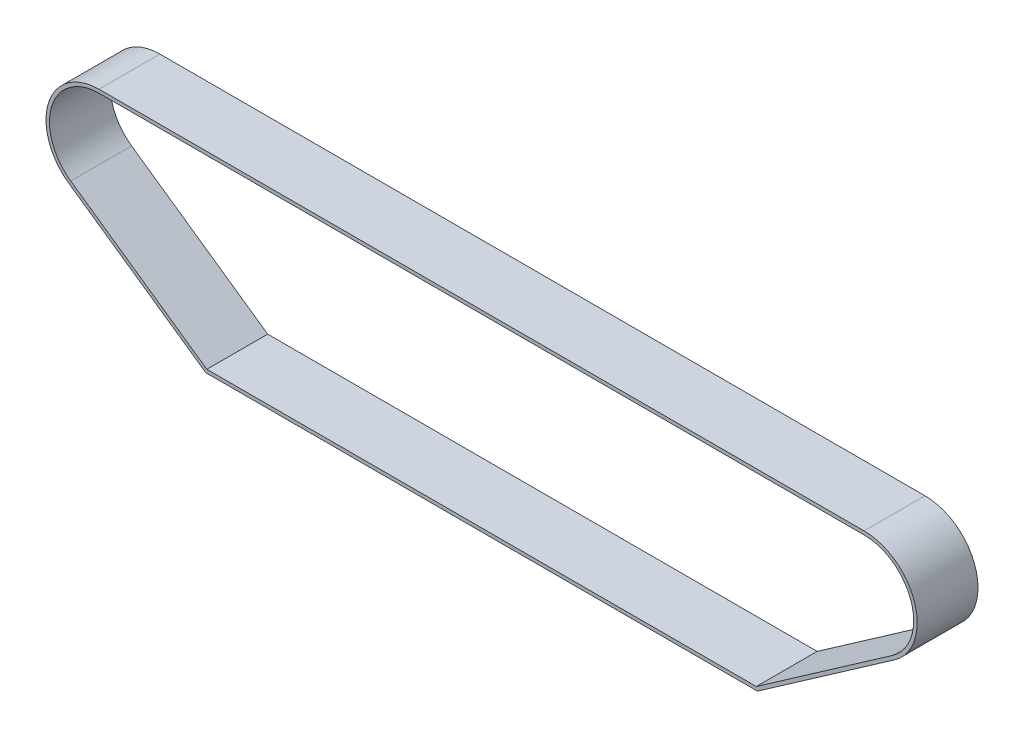
ISO-10303-21;
HEADER;
FILE_DESCRIPTION(('STEP AP214'),'2;1');
FILE_NAME('part.step','',(''),(''),'','','');
FILE_SCHEMA(('AUTOMOTIVE_DESIGN { 1 0 10303 214 1 1 1 1 }'));
ENDSEC;
DATA;
#1=APPLICATION_CONTEXT('core data for automotive mechanical design processes');
#2=APPLICATION_PROTOCOL_DEFINITION('international standard','automotive_design',2000,#1);
#3=PRODUCT_CONTEXT('',#1,'mechanical');
#4=PRODUCT('Part','Part','',(#3));
#5=PRODUCT_RELATED_PRODUCT_CATEGORY('part','',(#4));
#6=PRODUCT_DEFINITION_FORMATION('','',#4);
#7=PRODUCT_DEFINITION_CONTEXT('part definition',#1,'design');
#8=PRODUCT_DEFINITION('design','',#6,#7);
#9=PRODUCT_DEFINITION_SHAPE('','',#8);
#10=(LENGTH_UNIT() NAMED_UNIT(*) SI_UNIT(.MILLI.,.METRE.));
#11=(NAMED_UNIT(*) PLANE_ANGLE_UNIT() SI_UNIT($,.RADIAN.));
#12=(NAMED_UNIT(*) SI_UNIT($,.STERADIAN.) SOLID_ANGLE_UNIT());
#13=UNCERTAINTY_MEASURE_WITH_UNIT(LENGTH_MEASURE(1.E-05),#10,'distance_accuracy_value','');
#14=(GEOMETRIC_REPRESENTATION_CONTEXT(3) GLOBAL_UNCERTAINTY_ASSIGNED_CONTEXT((#13)) GLOBAL_UNIT_ASSIGNED_CONTEXT((#10,
#11,#12)) REPRESENTATION_CONTEXT('',''));
#15=CARTESIAN_POINT('',(0.,0.,0.));
#16=DIRECTION('',(0.,0.,1.));
#17=DIRECTION('',(1.,0.,0.));
#18=AXIS2_PLACEMENT_3D('',#15,#16,#17);
#19=CARTESIAN_POINT('',(-220.,0.,35.));
#20=DIRECTION('',(0.,0.,1.));
#21=DIRECTION('',(1.,0.,0.));
#22=AXIS2_PLACEMENT_3D('',#19,#20,#21);
#23=PLANE('',#22);
#24=CARTESIAN_POINT('',(-220.,0.,35.));
#25=DIRECTION('',(0.,0.,1.));
#26=DIRECTION('',(1.,0.,0.));
#27=AXIS2_PLACEMENT_3D('',#24,#25,#26);
#28=CIRCLE('',#27,30.5);
#29=CARTESIAN_POINT('',(-220.,30.5,35.));
#30=VERTEX_POINT('',#29);
#31=CARTESIAN_POINT('',(-237.450135308847,-25.0148511429297,35.));
#32=VERTEX_POINT('',#31);
#33=EDGE_CURVE('E212',#30,#32,#28,.T.);
#34=ORIENTED_EDGE('',*,*,#33,.T.);
#35=DIRECTION('',(0.820159053866547,-0.572135583896624,0.));
#36=VECTOR('',#35,1.);
#37=CARTESIAN_POINT('',(-159.144271167793,-79.6403181077331,35.));
#38=LINE('',#37,#36);
#39=CARTESIAN_POINT('',(-158.628665481383,-80.,35.));
#40=VERTEX_POINT('',#39);
#41=EDGE_CURVE('E215',#32,#40,#38,.T.);
#42=ORIENTED_EDGE('',*,*,#41,.T.);
#43=DIRECTION('',(1.,0.,0.));
#44=VECTOR('',#43,1.);
#45=CARTESIAN_POINT('',(158.,-80.,35.));
#46=LINE('',#45,#44);
#47=CARTESIAN_POINT('',(158.628665481383,-80.,35.));
#48=VERTEX_POINT('',#47);
#49=EDGE_CURVE('E218',#40,#48,#46,.T.);
#50=ORIENTED_EDGE('',*,*,#49,.T.);
#51=DIRECTION('',(0.820159053866547,0.572135583896624,0.));
#52=VECTOR('',#51,1.);
#53=CARTESIAN_POINT('',(159.144271167793,-79.6403181077331,35.));
#54=LINE('',#53,#52);
#55=CARTESIAN_POINT('',(237.450135308847,-25.0148511429296,35.));
#56=VERTEX_POINT('',#55);
#57=EDGE_CURVE('E220',#48,#56,#54,.T.);
#58=ORIENTED_EDGE('',*,*,#57,.T.);
#59=CARTESIAN_POINT('',(220.,0.,35.));
#60=DIRECTION('',(0.,0.,1.));
#61=DIRECTION('',(1.,0.,0.));
#62=AXIS2_PLACEMENT_3D('',#59,#60,#61);
#63=CIRCLE('',#62,30.5);
#64=CARTESIAN_POINT('',(220.,30.5000000000001,35.));
#65=VERTEX_POINT('',#64);
#66=EDGE_CURVE('E222',#56,#65,#63,.T.);
#67=ORIENTED_EDGE('',*,*,#66,.T.);
#68=DIRECTION('',(-1.,0.,0.));
#69=VECTOR('',#68,1.);
#70=CARTESIAN_POINT('',(-220.,30.5,35.));
#71=LINE('',#70,#69);
#72=EDGE_CURVE('E224',#65,#30,#71,.T.);
#73=ORIENTED_EDGE('',*,*,#72,.T.);
#74=EDGE_LOOP('',(#34,#42,#50,#58,#67,#73));
#75=FACE_BOUND('',#74,.T.);
#76=DIRECTION('',(0.820159053866547,-0.572135583896624,0.));
#77=VECTOR('',#76,1.);
#78=CARTESIAN_POINT('',(-158.,-78.,35.));
#79=LINE('',#78,#77);
#80=CARTESIAN_POINT('',(-236.305864141054,-23.3745330351966,35.));
#81=VERTEX_POINT('',#80);
#82=CARTESIAN_POINT('',(-158.,-78.,35.));
#83=VERTEX_POINT('',#82);
#84=EDGE_CURVE('E169',#81,#83,#79,.T.);
#85=ORIENTED_EDGE('',*,*,#84,.F.);
#86=CARTESIAN_POINT('',(-220.,0.,35.));
#87=DIRECTION('',(0.,0.,1.));
#88=DIRECTION('',(1.,0.,0.));
#89=AXIS2_PLACEMENT_3D('',#86,#87,#88);
#90=CIRCLE('',#89,28.5);
#91=CARTESIAN_POINT('',(-220.,28.5,35.));
#92=VERTEX_POINT('',#91);
#93=EDGE_CURVE('E161',#92,#81,#90,.T.);
#94=ORIENTED_EDGE('',*,*,#93,.F.);
#95=DIRECTION('',(-1.,0.,0.));
#96=VECTOR('',#95,1.);
#97=CARTESIAN_POINT('',(-220.,28.5,35.));
#98=LINE('',#97,#96);
#99=CARTESIAN_POINT('',(220.,28.5000000000001,35.));
#100=VERTEX_POINT('',#99);
#101=EDGE_CURVE('E190',#100,#92,#98,.T.);
#102=ORIENTED_EDGE('',*,*,#101,.F.);
#103=CARTESIAN_POINT('',(220.,0.,35.));
#104=DIRECTION('',(0.,0.,1.));
#105=DIRECTION('',(1.,0.,0.));
#106=AXIS2_PLACEMENT_3D('',#103,#104,#105);
#107=CIRCLE('',#106,28.5);
#108=CARTESIAN_POINT('',(236.305864141054,-23.3745330351965,35.));
#109=VERTEX_POINT('',#108);
#110=EDGE_CURVE('E188',#109,#100,#107,.T.);
#111=ORIENTED_EDGE('',*,*,#110,.F.);
#112=DIRECTION('',(0.820159053866547,0.572135583896624,0.));
#113=VECTOR('',#112,1.);
#114=CARTESIAN_POINT('',(158.,-78.,35.));
#115=LINE('',#114,#113);
#116=CARTESIAN_POINT('',(158.,-78.,35.));
#117=VERTEX_POINT('',#116);
#118=EDGE_CURVE('E184',#117,#109,#115,.T.);
#119=ORIENTED_EDGE('',*,*,#118,.F.);
#120=DIRECTION('',(1.,0.,0.));
#121=VECTOR('',#120,1.);
#122=CARTESIAN_POINT('',(158.,-78.,35.));
#123=LINE('',#122,#121);
#124=EDGE_CURVE('E182',#83,#117,#123,.T.);
#125=ORIENTED_EDGE('',*,*,#124,.F.);
#126=EDGE_LOOP('',(#85,#94,#102,#111,#119,#125));
#127=FACE_BOUND('',#126,.T.);
#128=ADVANCED_FACE('F72',(#75,#127),#23,.T.);
#129=CARTESIAN_POINT('',(-220.,0.,0.));
#130=DIRECTION('',(0.,0.,1.));
#131=DIRECTION('',(1.,0.,0.));
#132=AXIS2_PLACEMENT_3D('',#129,#130,#131);
#133=PLANE('',#132);
#134=CARTESIAN_POINT('',(-220.,0.,0.));
#135=DIRECTION('',(0.,0.,1.));
#136=DIRECTION('',(1.,0.,0.));
#137=AXIS2_PLACEMENT_3D('',#134,#135,#136);
#138=CIRCLE('',#137,30.5);
#139=CARTESIAN_POINT('',(-220.,30.5,0.));
#140=VERTEX_POINT('',#139);
#141=CARTESIAN_POINT('',(-237.450135308847,-25.0148511429297,0.));
#142=VERTEX_POINT('',#141);
#143=EDGE_CURVE('E177',#140,#142,#138,.T.);
#144=ORIENTED_EDGE('',*,*,#143,.F.);
#145=DIRECTION('',(-1.,0.,0.));
#146=VECTOR('',#145,1.);
#147=CARTESIAN_POINT('',(-220.,30.5,0.));
#148=LINE('',#147,#146);
#149=CARTESIAN_POINT('',(220.,30.5000000000001,0.));
#150=VERTEX_POINT('',#149);
#151=EDGE_CURVE('E216',#150,#140,#148,.T.);
#152=ORIENTED_EDGE('',*,*,#151,.F.);
#153=CARTESIAN_POINT('',(220.,0.,0.));
#154=DIRECTION('',(0.,0.,1.));
#155=DIRECTION('',(1.,0.,0.));
#156=AXIS2_PLACEMENT_3D('',#153,#154,#155);
#157=CIRCLE('',#156,30.5);
#158=CARTESIAN_POINT('',(237.450135308847,-25.0148511429296,0.));
#159=VERTEX_POINT('',#158);
#160=EDGE_CURVE('E235',#159,#150,#157,.T.);
#161=ORIENTED_EDGE('',*,*,#160,.F.);
#162=DIRECTION('',(0.820159053866547,0.572135583896624,0.));
#163=VECTOR('',#162,1.);
#164=CARTESIAN_POINT('',(159.144271167793,-79.6403181077331,0.));
#165=LINE('',#164,#163);
#166=CARTESIAN_POINT('',(158.628665481383,-80.,0.));
#167=VERTEX_POINT('',#166);
#168=EDGE_CURVE('E233',#167,#159,#165,.T.);
#169=ORIENTED_EDGE('',*,*,#168,.F.);
#170=DIRECTION('',(1.,0.,0.));
#171=VECTOR('',#170,1.);
#172=CARTESIAN_POINT('',(158.,-80.,0.));
#173=LINE('',#172,#171);
#174=CARTESIAN_POINT('',(-158.628665481383,-80.,0.));
#175=VERTEX_POINT('',#174);
#176=EDGE_CURVE('E231',#175,#167,#173,.T.);
#177=ORIENTED_EDGE('',*,*,#176,.F.);
#178=DIRECTION('',(0.820159053866547,-0.572135583896624,0.));
#179=VECTOR('',#178,1.);
#180=CARTESIAN_POINT('',(-159.144271167793,-79.6403181077331,0.));
#181=LINE('',#180,#179);
#182=EDGE_CURVE('E229',#142,#175,#181,.T.);
#183=ORIENTED_EDGE('',*,*,#182,.F.);
#184=EDGE_LOOP('',(#144,#152,#161,#169,#177,#183));
#185=FACE_BOUND('',#184,.T.);
#186=CARTESIAN_POINT('',(-220.,0.,0.));
#187=DIRECTION('',(0.,0.,1.));
#188=DIRECTION('',(1.,0.,0.));
#189=AXIS2_PLACEMENT_3D('',#186,#187,#188);
#190=CIRCLE('',#189,28.5);
#191=CARTESIAN_POINT('',(-220.,28.5,0.));
#192=VERTEX_POINT('',#191);
#193=CARTESIAN_POINT('',(-236.305864141054,-23.3745330351966,0.));
#194=VERTEX_POINT('',#193);
#195=EDGE_CURVE('E95',#192,#194,#190,.T.);
#196=ORIENTED_EDGE('',*,*,#195,.T.);
#197=DIRECTION('',(0.820159053866547,-0.572135583896624,0.));
#198=VECTOR('',#197,1.);
#199=CARTESIAN_POINT('',(-158.,-78.,0.));
#200=LINE('',#199,#198);
#201=CARTESIAN_POINT('',(-158.,-78.,0.));
#202=VERTEX_POINT('',#201);
#203=EDGE_CURVE('E176',#194,#202,#200,.T.);
#204=ORIENTED_EDGE('',*,*,#203,.T.);
#205=DIRECTION('',(1.,0.,0.));
#206=VECTOR('',#205,1.);
#207=CARTESIAN_POINT('',(158.,-78.,0.));
#208=LINE('',#207,#206);
#209=CARTESIAN_POINT('',(158.,-78.,0.));
#210=VERTEX_POINT('',#209);
#211=EDGE_CURVE('E194',#202,#210,#208,.T.);
#212=ORIENTED_EDGE('',*,*,#211,.T.);
#213=DIRECTION('',(0.820159053866547,0.572135583896624,0.));
#214=VECTOR('',#213,1.);
#215=CARTESIAN_POINT('',(158.,-78.,0.));
#216=LINE('',#215,#214);
#217=CARTESIAN_POINT('',(236.305864141054,-23.3745330351965,0.));
#218=VERTEX_POINT('',#217);
#219=EDGE_CURVE('E197',#210,#218,#216,.T.);
#220=ORIENTED_EDGE('',*,*,#219,.T.);
#221=CARTESIAN_POINT('',(220.,0.,0.));
#222=DIRECTION('',(0.,0.,1.));
#223=DIRECTION('',(1.,0.,0.));
#224=AXIS2_PLACEMENT_3D('',#221,#222,#223);
#225=CIRCLE('',#224,28.5);
#226=CARTESIAN_POINT('',(220.,28.5000000000001,0.));
#227=VERTEX_POINT('',#226);
#228=EDGE_CURVE('E200',#218,#227,#225,.T.);
#229=ORIENTED_EDGE('',*,*,#228,.T.);
#230=DIRECTION('',(-1.,0.,0.));
#231=VECTOR('',#230,1.);
#232=CARTESIAN_POINT('',(-220.,28.5,0.));
#233=LINE('',#232,#231);
#234=EDGE_CURVE('E170',#227,#192,#233,.T.);
#235=ORIENTED_EDGE('',*,*,#234,.T.);
#236=EDGE_LOOP('',(#196,#204,#212,#220,#229,#235));
#237=FACE_BOUND('',#236,.T.);
#238=ADVANCED_FACE('F259',(#185,#237),#133,.F.);
#239=CARTESIAN_POINT('',(-220.,0.,35.));
#240=DIRECTION('',(0.,0.,-1.));
#241=DIRECTION('',(-1.,0.,0.));
#242=AXIS2_PLACEMENT_3D('',#239,#240,#241);
#243=CYLINDRICAL_SURFACE('',#242,30.5);
#244=ORIENTED_EDGE('',*,*,#143,.T.);
#245=DIRECTION('',(0.,0.,-1.));
#246=VECTOR('',#245,1.);
#247=CARTESIAN_POINT('',(-237.450135308847,-25.0148511429297,35.));
#248=LINE('',#247,#246);
#249=EDGE_CURVE('E12',#32,#142,#248,.T.);
#250=ORIENTED_EDGE('',*,*,#249,.F.);
#251=ORIENTED_EDGE('',*,*,#33,.F.);
#252=DIRECTION('',(0.,0.,-1.));
#253=VECTOR('',#252,1.);
#254=CARTESIAN_POINT('',(-220.,30.5,35.));
#255=LINE('',#254,#253);
#256=EDGE_CURVE('E226',#30,#140,#255,.T.);
#257=ORIENTED_EDGE('',*,*,#256,.T.);
#258=EDGE_LOOP('',(#244,#250,#251,#257));
#259=FACE_BOUND('',#258,.T.);
#260=ADVANCED_FACE('F74',(#259),#243,.T.);
#261=CARTESIAN_POINT('',(-159.144271167793,-79.6403181077331,35.));
#262=DIRECTION('',(0.572135583896624,0.820159053866547,0.));
#263=DIRECTION('',(-0.820159053866547,0.572135583896624,0.));
#264=AXIS2_PLACEMENT_3D('',#261,#262,#263);
#265=PLANE('',#264);
#266=ORIENTED_EDGE('',*,*,#182,.T.);
#267=DIRECTION('',(0.,0.,-1.));
#268=VECTOR('',#267,1.);
#269=CARTESIAN_POINT('',(-158.628665481383,-80.,35.));
#270=LINE('',#269,#268);
#271=EDGE_CURVE('E80',#40,#175,#270,.T.);
#272=ORIENTED_EDGE('',*,*,#271,.F.);
#273=ORIENTED_EDGE('',*,*,#41,.F.);
#274=ORIENTED_EDGE('',*,*,#249,.T.);
#275=EDGE_LOOP('',(#266,#272,#273,#274));
#276=FACE_BOUND('',#275,.T.);
#277=ADVANCED_FACE('F276',(#276),#265,.F.);
#278=CARTESIAN_POINT('',(158.,-80.,35.));
#279=DIRECTION('',(0.,1.,0.));
#280=DIRECTION('',(-1.,0.,0.));
#281=AXIS2_PLACEMENT_3D('',#278,#279,#280);
#282=PLANE('',#281);
#283=ORIENTED_EDGE('',*,*,#176,.T.);
#284=DIRECTION('',(0.,0.,-1.));
#285=VECTOR('',#284,1.);
#286=CARTESIAN_POINT('',(158.628665481383,-80.,35.));
#287=LINE('',#286,#285);
#288=EDGE_CURVE('E246',#48,#167,#287,.T.);
#289=ORIENTED_EDGE('',*,*,#288,.F.);
#290=ORIENTED_EDGE('',*,*,#49,.F.);
#291=ORIENTED_EDGE('',*,*,#271,.T.);
#292=EDGE_LOOP('',(#283,#289,#290,#291));
#293=FACE_BOUND('',#292,.T.);
#294=ADVANCED_FACE('F253',(#293),#282,.F.);
#295=CARTESIAN_POINT('',(159.144271167793,-79.6403181077331,35.));
#296=DIRECTION('',(-0.572135583896624,0.820159053866547,0.));
#297=DIRECTION('',(-0.820159053866547,-0.572135583896624,0.));
#298=AXIS2_PLACEMENT_3D('',#295,#296,#297);
#299=PLANE('',#298);
#300=ORIENTED_EDGE('',*,*,#168,.T.);
#301=DIRECTION('',(0.,0.,-1.));
#302=VECTOR('',#301,1.);
#303=CARTESIAN_POINT('',(237.450135308847,-25.0148511429296,35.));
#304=LINE('',#303,#302);
#305=EDGE_CURVE('E243',#56,#159,#304,.T.);
#306=ORIENTED_EDGE('',*,*,#305,.F.);
#307=ORIENTED_EDGE('',*,*,#57,.F.);
#308=ORIENTED_EDGE('',*,*,#288,.T.);
#309=EDGE_LOOP('',(#300,#306,#307,#308));
#310=FACE_BOUND('',#309,.T.);
#311=ADVANCED_FACE('F265',(#310),#299,.F.);
#312=CARTESIAN_POINT('',(220.,0.,35.));
#313=DIRECTION('',(0.,0.,-1.));
#314=DIRECTION('',(-1.,0.,0.));
#315=AXIS2_PLACEMENT_3D('',#312,#313,#314);
#316=CYLINDRICAL_SURFACE('',#315,30.5);
#317=ORIENTED_EDGE('',*,*,#160,.T.);
#318=DIRECTION('',(0.,0.,-1.));
#319=VECTOR('',#318,1.);
#320=CARTESIAN_POINT('',(220.,30.5000000000001,35.));
#321=LINE('',#320,#319);
#322=EDGE_CURVE('E240',#65,#150,#321,.T.);
#323=ORIENTED_EDGE('',*,*,#322,.F.);
#324=ORIENTED_EDGE('',*,*,#66,.F.);
#325=ORIENTED_EDGE('',*,*,#305,.T.);
#326=EDGE_LOOP('',(#317,#323,#324,#325));
#327=FACE_BOUND('',#326,.T.);
#328=ADVANCED_FACE('F269',(#327),#316,.T.);
#329=CARTESIAN_POINT('',(-220.,30.5,35.));
#330=DIRECTION('',(0.,-1.,0.));
#331=DIRECTION('',(1.,0.,0.));
#332=AXIS2_PLACEMENT_3D('',#329,#330,#331);
#333=PLANE('',#332);
#334=ORIENTED_EDGE('',*,*,#151,.T.);
#335=ORIENTED_EDGE('',*,*,#256,.F.);
#336=ORIENTED_EDGE('',*,*,#72,.F.);
#337=ORIENTED_EDGE('',*,*,#322,.T.);
#338=EDGE_LOOP('',(#334,#335,#336,#337));
#339=FACE_BOUND('',#338,.T.);
#340=ADVANCED_FACE('F279',(#339),#333,.F.);
#341=CARTESIAN_POINT('',(-220.,0.,35.));
#342=DIRECTION('',(0.,0.,-1.));
#343=DIRECTION('',(-1.,0.,0.));
#344=AXIS2_PLACEMENT_3D('',#341,#342,#343);
#345=CYLINDRICAL_SURFACE('',#344,28.5);
#346=ORIENTED_EDGE('',*,*,#195,.F.);
#347=DIRECTION('',(0.,0.,-1.));
#348=VECTOR('',#347,1.);
#349=CARTESIAN_POINT('',(-220.,28.5,35.));
#350=LINE('',#349,#348);
#351=EDGE_CURVE('E165',#92,#192,#350,.T.);
#352=ORIENTED_EDGE('',*,*,#351,.F.);
#353=ORIENTED_EDGE('',*,*,#93,.T.);
#354=DIRECTION('',(0.,0.,-1.));
#355=VECTOR('',#354,1.);
#356=CARTESIAN_POINT('',(-236.305864141054,-23.3745330351966,35.));
#357=LINE('',#356,#355);
#358=EDGE_CURVE('E164',#81,#194,#357,.T.);
#359=ORIENTED_EDGE('',*,*,#358,.T.);
#360=EDGE_LOOP('',(#346,#352,#353,#359));
#361=FACE_BOUND('',#360,.T.);
#362=ADVANCED_FACE('F163',(#361),#345,.F.);
#363=CARTESIAN_POINT('',(-158.,-78.,35.));
#364=DIRECTION('',(0.572135583896624,0.820159053866547,0.));
#365=DIRECTION('',(-0.820159053866547,0.572135583896624,0.));
#366=AXIS2_PLACEMENT_3D('',#363,#364,#365);
#367=PLANE('',#366);
#368=ORIENTED_EDGE('',*,*,#203,.F.);
#369=ORIENTED_EDGE('',*,*,#358,.F.);
#370=ORIENTED_EDGE('',*,*,#84,.T.);
#371=DIRECTION('',(0.,0.,-1.));
#372=VECTOR('',#371,1.);
#373=CARTESIAN_POINT('',(-158.,-78.,35.));
#374=LINE('',#373,#372);
#375=EDGE_CURVE('E178',#83,#202,#374,.T.);
#376=ORIENTED_EDGE('',*,*,#375,.T.);
#377=EDGE_LOOP('',(#368,#369,#370,#376));
#378=FACE_BOUND('',#377,.T.);
#379=ADVANCED_FACE('F173',(#378),#367,.T.);
#380=CARTESIAN_POINT('',(158.,-78.,35.));
#381=DIRECTION('',(0.,1.,0.));
#382=DIRECTION('',(-1.,0.,0.));
#383=AXIS2_PLACEMENT_3D('',#380,#381,#382);
#384=PLANE('',#383);
#385=ORIENTED_EDGE('',*,*,#211,.F.);
#386=ORIENTED_EDGE('',*,*,#375,.F.);
#387=ORIENTED_EDGE('',*,*,#124,.T.);
#388=DIRECTION('',(0.,0.,-1.));
#389=VECTOR('',#388,1.);
#390=CARTESIAN_POINT('',(158.,-78.,35.));
#391=LINE('',#390,#389);
#392=EDGE_CURVE('E209',#117,#210,#391,.T.);
#393=ORIENTED_EDGE('',*,*,#392,.T.);
#394=EDGE_LOOP('',(#385,#386,#387,#393));
#395=FACE_BOUND('',#394,.T.);
#396=ADVANCED_FACE('F297',(#395),#384,.T.);
#397=CARTESIAN_POINT('',(158.,-78.,35.));
#398=DIRECTION('',(-0.572135583896624,0.820159053866547,0.));
#399=DIRECTION('',(-0.820159053866547,-0.572135583896624,0.));
#400=AXIS2_PLACEMENT_3D('',#397,#398,#399);
#401=PLANE('',#400);
#402=ORIENTED_EDGE('',*,*,#219,.F.);
#403=ORIENTED_EDGE('',*,*,#392,.F.);
#404=ORIENTED_EDGE('',*,*,#118,.T.);
#405=DIRECTION('',(0.,0.,-1.));
#406=VECTOR('',#405,1.);
#407=CARTESIAN_POINT('',(236.305864141054,-23.3745330351965,35.));
#408=LINE('',#407,#406);
#409=EDGE_CURVE('E207',#109,#218,#408,.T.);
#410=ORIENTED_EDGE('',*,*,#409,.T.);
#411=EDGE_LOOP('',(#402,#403,#404,#410));
#412=FACE_BOUND('',#411,.T.);
#413=ADVANCED_FACE('F300',(#412),#401,.T.);
#414=CARTESIAN_POINT('',(220.,0.,35.));
#415=DIRECTION('',(0.,0.,-1.));
#416=DIRECTION('',(-1.,0.,0.));
#417=AXIS2_PLACEMENT_3D('',#414,#415,#416);
#418=CYLINDRICAL_SURFACE('',#417,28.5);
#419=ORIENTED_EDGE('',*,*,#228,.F.);
#420=ORIENTED_EDGE('',*,*,#409,.F.);
#421=ORIENTED_EDGE('',*,*,#110,.T.);
#422=DIRECTION('',(0.,0.,-1.));
#423=VECTOR('',#422,1.);
#424=CARTESIAN_POINT('',(220.,28.5000000000001,35.));
#425=LINE('',#424,#423);
#426=EDGE_CURVE('E87',#100,#227,#425,.T.);
#427=ORIENTED_EDGE('',*,*,#426,.T.);
#428=EDGE_LOOP('',(#419,#420,#421,#427));
#429=FACE_BOUND('',#428,.T.);
#430=ADVANCED_FACE('F304',(#429),#418,.F.);
#431=CARTESIAN_POINT('',(-220.,28.5,35.));
#432=DIRECTION('',(0.,-1.,0.));
#433=DIRECTION('',(1.,0.,0.));
#434=AXIS2_PLACEMENT_3D('',#431,#432,#433);
#435=PLANE('',#434);
#436=ORIENTED_EDGE('',*,*,#234,.F.);
#437=ORIENTED_EDGE('',*,*,#426,.F.);
#438=ORIENTED_EDGE('',*,*,#101,.T.);
#439=ORIENTED_EDGE('',*,*,#351,.T.);
#440=EDGE_LOOP('',(#436,#437,#438,#439));
#441=FACE_BOUND('',#440,.T.);
#442=ADVANCED_FACE('F308',(#441),#435,.T.);
#443=CLOSED_SHELL('',(#128,#238,#260,#277,#294,#311,#328,#340,#362,#379,#396,#413,#430,#442));
#444=MANIFOLD_SOLID_BREP('B2',#443);
#445=ADVANCED_BREP_SHAPE_REPRESENTATION('',(#18,#444),#14);
#446=SHAPE_DEFINITION_REPRESENTATION(#9,#445);
ENDSEC;
END-ISO-10303-21;
